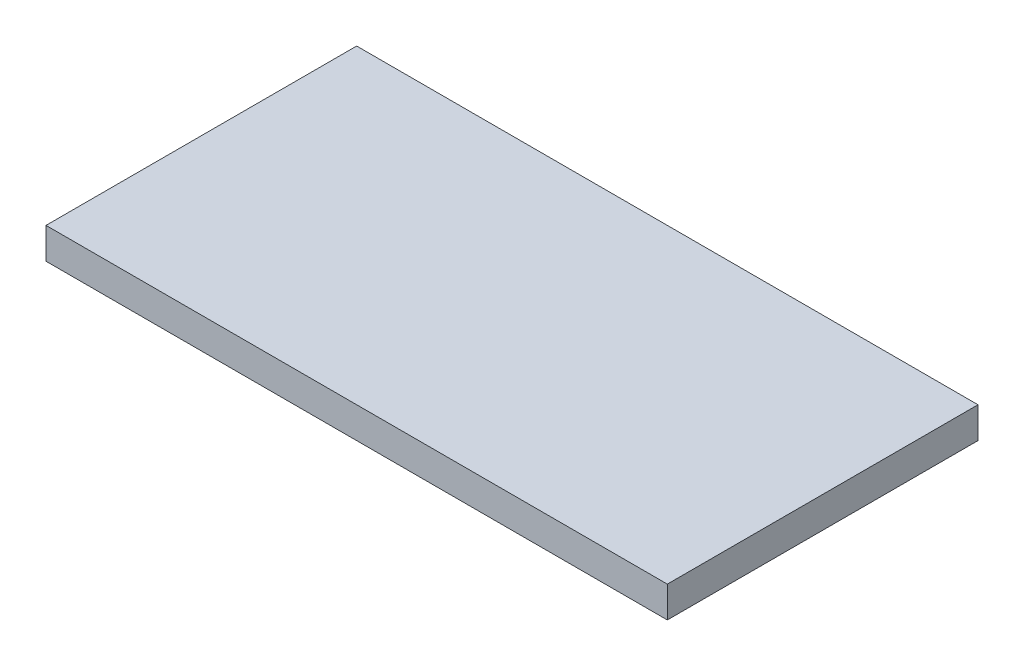
ISO-10303-21;
HEADER;
FILE_DESCRIPTION(('STEP AP214'),'2;1');
FILE_NAME('part.step','',(''),(''),'','','');
FILE_SCHEMA(('AUTOMOTIVE_DESIGN { 1 0 10303 214 1 1 1 1 }'));
ENDSEC;
DATA;
#1=APPLICATION_CONTEXT('core data for automotive mechanical design processes');
#2=APPLICATION_PROTOCOL_DEFINITION('international standard','automotive_design',2000,#1);
#3=PRODUCT_CONTEXT('',#1,'mechanical');
#4=PRODUCT('Part','Part','',(#3));
#5=PRODUCT_RELATED_PRODUCT_CATEGORY('part','',(#4));
#6=PRODUCT_DEFINITION_FORMATION('','',#4);
#7=PRODUCT_DEFINITION_CONTEXT('part definition',#1,'design');
#8=PRODUCT_DEFINITION('design','',#6,#7);
#9=PRODUCT_DEFINITION_SHAPE('','',#8);
#10=(LENGTH_UNIT() NAMED_UNIT(*) SI_UNIT(.MILLI.,.METRE.));
#11=(NAMED_UNIT(*) PLANE_ANGLE_UNIT() SI_UNIT($,.RADIAN.));
#12=(NAMED_UNIT(*) SI_UNIT($,.STERADIAN.) SOLID_ANGLE_UNIT());
#13=UNCERTAINTY_MEASURE_WITH_UNIT(LENGTH_MEASURE(1.E-05),#10,'distance_accuracy_value','');
#14=(GEOMETRIC_REPRESENTATION_CONTEXT(3) GLOBAL_UNCERTAINTY_ASSIGNED_CONTEXT((#13)) GLOBAL_UNIT_ASSIGNED_CONTEXT((#10,
#11,#12)) REPRESENTATION_CONTEXT('',''));
#15=CARTESIAN_POINT('',(0.,0.,0.));
#16=DIRECTION('',(0.,0.,1.));
#17=DIRECTION('',(1.,0.,0.));
#18=AXIS2_PLACEMENT_3D('',#15,#16,#17);
#19=CARTESIAN_POINT('',(50.8,-5.08,25.4));
#20=DIRECTION('',(1.,0.,0.));
#21=DIRECTION('',(0.,0.,-1.));
#22=AXIS2_PLACEMENT_3D('',#19,#20,#21);
#23=PLANE('',#22);
#24=DIRECTION('',(0.,0.,-1.));
#25=VECTOR('',#24,1.);
#26=CARTESIAN_POINT('',(50.8,0.,25.4));
#27=LINE('',#26,#25);
#28=CARTESIAN_POINT('',(50.8,0.,25.4));
#29=VERTEX_POINT('',#28);
#30=CARTESIAN_POINT('',(50.8,0.,-25.4));
#31=VERTEX_POINT('',#30);
#32=EDGE_CURVE('E117',#29,#31,#27,.T.);
#33=ORIENTED_EDGE('',*,*,#32,.F.);
#34=DIRECTION('',(0.,1.,0.));
#35=VECTOR('',#34,1.);
#36=CARTESIAN_POINT('',(50.8,-5.08,25.4));
#37=LINE('',#36,#35);
#38=CARTESIAN_POINT('',(50.8,-5.08,25.4));
#39=VERTEX_POINT('',#38);
#40=EDGE_CURVE('E11',#39,#29,#37,.T.);
#41=ORIENTED_EDGE('',*,*,#40,.F.);
#42=DIRECTION('',(0.,0.,-1.));
#43=VECTOR('',#42,1.);
#44=CARTESIAN_POINT('',(50.8,-5.08,25.4));
#45=LINE('',#44,#43);
#46=CARTESIAN_POINT('',(50.8,-5.08,-25.4));
#47=VERTEX_POINT('',#46);
#48=EDGE_CURVE('E109',#39,#47,#45,.T.);
#49=ORIENTED_EDGE('',*,*,#48,.T.);
#50=DIRECTION('',(0.,1.,0.));
#51=VECTOR('',#50,1.);
#52=CARTESIAN_POINT('',(50.8,-5.08,-25.4));
#53=LINE('',#52,#51);
#54=EDGE_CURVE('E50',#47,#31,#53,.T.);
#55=ORIENTED_EDGE('',*,*,#54,.T.);
#56=EDGE_LOOP('',(#33,#41,#49,#55));
#57=FACE_BOUND('',#56,.T.);
#58=ADVANCED_FACE('F47',(#57),#23,.T.);
#59=CARTESIAN_POINT('',(-50.8,-5.08,25.4));
#60=DIRECTION('',(0.,0.,1.));
#61=DIRECTION('',(1.,0.,0.));
#62=AXIS2_PLACEMENT_3D('',#59,#60,#61);
#63=PLANE('',#62);
#64=DIRECTION('',(1.,0.,0.));
#65=VECTOR('',#64,1.);
#66=CARTESIAN_POINT('',(-50.8,0.,25.4));
#67=LINE('',#66,#65);
#68=CARTESIAN_POINT('',(-50.8,0.,25.4));
#69=VERTEX_POINT('',#68);
#70=EDGE_CURVE('E112',#69,#29,#67,.T.);
#71=ORIENTED_EDGE('',*,*,#70,.F.);
#72=DIRECTION('',(0.,1.,0.));
#73=VECTOR('',#72,1.);
#74=CARTESIAN_POINT('',(-50.8,-5.08,25.4));
#75=LINE('',#74,#73);
#76=CARTESIAN_POINT('',(-50.8,-5.08,25.4));
#77=VERTEX_POINT('',#76);
#78=EDGE_CURVE('E57',#77,#69,#75,.T.);
#79=ORIENTED_EDGE('',*,*,#78,.F.);
#80=DIRECTION('',(1.,0.,0.));
#81=VECTOR('',#80,1.);
#82=CARTESIAN_POINT('',(-50.8,-5.08,25.4));
#83=LINE('',#82,#81);
#84=EDGE_CURVE('E104',#77,#39,#83,.T.);
#85=ORIENTED_EDGE('',*,*,#84,.T.);
#86=ORIENTED_EDGE('',*,*,#40,.T.);
#87=EDGE_LOOP('',(#71,#79,#85,#86));
#88=FACE_BOUND('',#87,.T.);
#89=ADVANCED_FACE('F133',(#88),#63,.T.);
#90=CARTESIAN_POINT('',(-50.8,-5.08,25.4));
#91=DIRECTION('',(-1.,0.,0.));
#92=DIRECTION('',(0.,0.,1.));
#93=AXIS2_PLACEMENT_3D('',#90,#91,#92);
#94=PLANE('',#93);
#95=DIRECTION('',(0.,0.,1.));
#96=VECTOR('',#95,1.);
#97=CARTESIAN_POINT('',(-50.8,0.,25.4));
#98=LINE('',#97,#96);
#99=CARTESIAN_POINT('',(-50.8,0.,-25.4));
#100=VERTEX_POINT('',#99);
#101=EDGE_CURVE('E98',#100,#69,#98,.T.);
#102=ORIENTED_EDGE('',*,*,#101,.F.);
#103=DIRECTION('',(0.,1.,0.));
#104=VECTOR('',#103,1.);
#105=CARTESIAN_POINT('',(-50.8,-5.08,-25.4));
#106=LINE('',#105,#104);
#107=CARTESIAN_POINT('',(-50.8,-5.08,-25.4));
#108=VERTEX_POINT('',#107);
#109=EDGE_CURVE('E93',#108,#100,#106,.T.);
#110=ORIENTED_EDGE('',*,*,#109,.F.);
#111=DIRECTION('',(0.,0.,1.));
#112=VECTOR('',#111,1.);
#113=CARTESIAN_POINT('',(-50.8,-5.08,25.4));
#114=LINE('',#113,#112);
#115=EDGE_CURVE('E96',#108,#77,#114,.T.);
#116=ORIENTED_EDGE('',*,*,#115,.T.);
#117=ORIENTED_EDGE('',*,*,#78,.T.);
#118=EDGE_LOOP('',(#102,#110,#116,#117));
#119=FACE_BOUND('',#118,.T.);
#120=ADVANCED_FACE('F95',(#119),#94,.T.);
#121=CARTESIAN_POINT('',(-50.8,-5.08,-25.4));
#122=DIRECTION('',(0.,0.,-1.));
#123=DIRECTION('',(-1.,0.,0.));
#124=AXIS2_PLACEMENT_3D('',#121,#122,#123);
#125=PLANE('',#124);
#126=DIRECTION('',(-1.,0.,0.));
#127=VECTOR('',#126,1.);
#128=CARTESIAN_POINT('',(-50.8,0.,-25.4));
#129=LINE('',#128,#127);
#130=EDGE_CURVE('E121',#31,#100,#129,.T.);
#131=ORIENTED_EDGE('',*,*,#130,.F.);
#132=ORIENTED_EDGE('',*,*,#54,.F.);
#133=DIRECTION('',(-1.,0.,0.));
#134=VECTOR('',#133,1.);
#135=CARTESIAN_POINT('',(-50.8,-5.08,-25.4));
#136=LINE('',#135,#134);
#137=EDGE_CURVE('E103',#47,#108,#136,.T.);
#138=ORIENTED_EDGE('',*,*,#137,.T.);
#139=ORIENTED_EDGE('',*,*,#109,.T.);
#140=EDGE_LOOP('',(#131,#132,#138,#139));
#141=FACE_BOUND('',#140,.T.);
#142=ADVANCED_FACE('F107',(#141),#125,.T.);
#143=CARTESIAN_POINT('',(0.,-5.08,0.));
#144=DIRECTION('',(0.,-1.,0.));
#145=DIRECTION('',(0.,0.,-1.));
#146=AXIS2_PLACEMENT_3D('',#143,#144,#145);
#147=PLANE('',#146);
#148=ORIENTED_EDGE('',*,*,#48,.F.);
#149=ORIENTED_EDGE('',*,*,#84,.F.);
#150=ORIENTED_EDGE('',*,*,#115,.F.);
#151=ORIENTED_EDGE('',*,*,#137,.F.);
#152=EDGE_LOOP('',(#148,#149,#150,#151));
#153=FACE_BOUND('',#152,.T.);
#154=ADVANCED_FACE('F102',(#153),#147,.T.);
#155=CARTESIAN_POINT('',(0.,0.,0.));
#156=DIRECTION('',(0.,-1.,0.));
#157=DIRECTION('',(0.,0.,-1.));
#158=AXIS2_PLACEMENT_3D('',#155,#156,#157);
#159=PLANE('',#158);
#160=ORIENTED_EDGE('',*,*,#32,.T.);
#161=ORIENTED_EDGE('',*,*,#130,.T.);
#162=ORIENTED_EDGE('',*,*,#101,.T.);
#163=ORIENTED_EDGE('',*,*,#70,.T.);
#164=EDGE_LOOP('',(#160,#161,#162,#163));
#165=FACE_BOUND('',#164,.T.);
#166=ADVANCED_FACE('F132',(#165),#159,.F.);
#167=CLOSED_SHELL('',(#58,#89,#120,#142,#154,#166));
#168=MANIFOLD_SOLID_BREP('B2',#167);
#169=ADVANCED_BREP_SHAPE_REPRESENTATION('',(#18,#168),#14);
#170=SHAPE_DEFINITION_REPRESENTATION(#9,#169);
ENDSEC;
END-ISO-10303-21;
